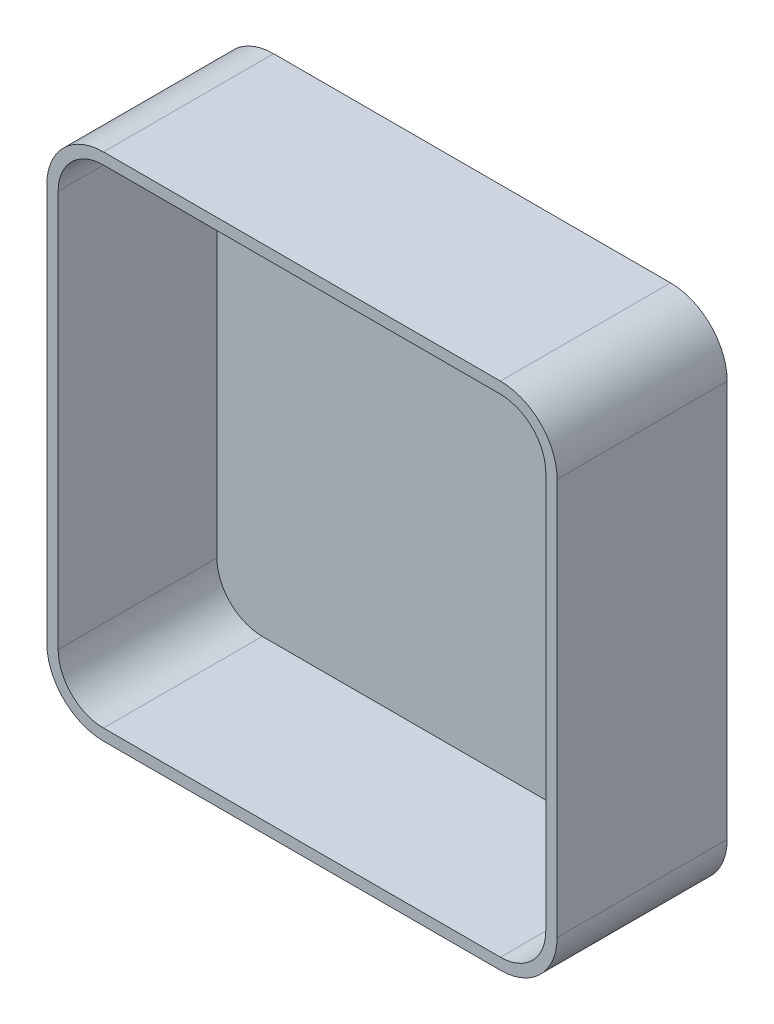
ISO-10303-21;
HEADER;
FILE_DESCRIPTION(('STEP AP214'),'2;1');
FILE_NAME('part.step','',(''),(''),'','','');
FILE_SCHEMA(('AUTOMOTIVE_DESIGN { 1 0 10303 214 1 1 1 1 }'));
ENDSEC;
DATA;
#1=APPLICATION_CONTEXT('core data for automotive mechanical design processes');
#2=APPLICATION_PROTOCOL_DEFINITION('international standard','automotive_design',2000,#1);
#3=PRODUCT_CONTEXT('',#1,'mechanical');
#4=PRODUCT('Part','Part','',(#3));
#5=PRODUCT_RELATED_PRODUCT_CATEGORY('part','',(#4));
#6=PRODUCT_DEFINITION_FORMATION('','',#4);
#7=PRODUCT_DEFINITION_CONTEXT('part definition',#1,'design');
#8=PRODUCT_DEFINITION('design','',#6,#7);
#9=PRODUCT_DEFINITION_SHAPE('','',#8);
#10=(LENGTH_UNIT() NAMED_UNIT(*) SI_UNIT(.MILLI.,.METRE.));
#11=(NAMED_UNIT(*) PLANE_ANGLE_UNIT() SI_UNIT($,.RADIAN.));
#12=(NAMED_UNIT(*) SI_UNIT($,.STERADIAN.) SOLID_ANGLE_UNIT());
#13=UNCERTAINTY_MEASURE_WITH_UNIT(LENGTH_MEASURE(1.E-05),#10,'distance_accuracy_value','');
#14=(GEOMETRIC_REPRESENTATION_CONTEXT(3) GLOBAL_UNCERTAINTY_ASSIGNED_CONTEXT((#13)) GLOBAL_UNIT_ASSIGNED_CONTEXT((#10,
#11,#12)) REPRESENTATION_CONTEXT('',''));
#15=CARTESIAN_POINT('',(0.,0.,0.));
#16=DIRECTION('',(0.,0.,1.));
#17=DIRECTION('',(1.,0.,0.));
#18=AXIS2_PLACEMENT_3D('',#15,#16,#17);
#19=CARTESIAN_POINT('',(0.,0.,15.));
#20=DIRECTION('',(1.,0.,0.));
#21=DIRECTION('',(0.,0.,-1.));
#22=AXIS2_PLACEMENT_3D('',#19,#20,#21);
#23=PLANE('',#22);
#24=DIRECTION('',(0.,-1.,0.));
#25=VECTOR('',#24,1.);
#26=CARTESIAN_POINT('',(0.,0.,0.));
#27=LINE('',#26,#25);
#28=CARTESIAN_POINT('',(0.,40.,0.));
#29=VERTEX_POINT('',#28);
#30=CARTESIAN_POINT('',(0.,5.,0.));
#31=VERTEX_POINT('',#30);
#32=EDGE_CURVE('E207',#29,#31,#27,.T.);
#33=ORIENTED_EDGE('',*,*,#32,.T.);
#34=DIRECTION('',(0.,0.,-1.));
#35=VECTOR('',#34,1.);
#36=CARTESIAN_POINT('',(0.,5.,15.));
#37=LINE('',#36,#35);
#38=CARTESIAN_POINT('',(0.,5.,15.));
#39=VERTEX_POINT('',#38);
#40=EDGE_CURVE('E258',#31,#39,#37,.F.);
#41=ORIENTED_EDGE('',*,*,#40,.T.);
#42=DIRECTION('',(0.,-1.,0.));
#43=VECTOR('',#42,1.);
#44=CARTESIAN_POINT('',(0.,0.,15.));
#45=LINE('',#44,#43);
#46=CARTESIAN_POINT('',(0.,40.,15.));
#47=VERTEX_POINT('',#46);
#48=EDGE_CURVE('E221',#47,#39,#45,.T.);
#49=ORIENTED_EDGE('',*,*,#48,.F.);
#50=DIRECTION('',(0.,0.,-1.));
#51=VECTOR('',#50,1.);
#52=CARTESIAN_POINT('',(0.,40.,15.));
#53=LINE('',#52,#51);
#54=EDGE_CURVE('E255',#47,#29,#53,.T.);
#55=ORIENTED_EDGE('',*,*,#54,.T.);
#56=EDGE_LOOP('',(#33,#41,#49,#55));
#57=FACE_BOUND('',#56,.T.);
#58=ADVANCED_FACE('F35',(#57),#23,.F.);
#59=CARTESIAN_POINT('',(0.,0.,15.));
#60=DIRECTION('',(0.,1.,0.));
#61=DIRECTION('',(0.,0.,1.));
#62=AXIS2_PLACEMENT_3D('',#59,#60,#61);
#63=PLANE('',#62);
#64=DIRECTION('',(1.,0.,0.));
#65=VECTOR('',#64,1.);
#66=CARTESIAN_POINT('',(0.,0.,15.));
#67=LINE('',#66,#65);
#68=CARTESIAN_POINT('',(5.,0.,15.));
#69=VERTEX_POINT('',#68);
#70=CARTESIAN_POINT('',(40.,0.,15.));
#71=VERTEX_POINT('',#70);
#72=EDGE_CURVE('E224',#69,#71,#67,.T.);
#73=ORIENTED_EDGE('',*,*,#72,.F.);
#74=DIRECTION('',(0.,0.,-1.));
#75=VECTOR('',#74,1.);
#76=CARTESIAN_POINT('',(5.,0.,15.));
#77=LINE('',#76,#75);
#78=CARTESIAN_POINT('',(5.,0.,0.));
#79=VERTEX_POINT('',#78);
#80=EDGE_CURVE('E244',#69,#79,#77,.T.);
#81=ORIENTED_EDGE('',*,*,#80,.T.);
#82=DIRECTION('',(1.,0.,0.));
#83=VECTOR('',#82,1.);
#84=CARTESIAN_POINT('',(0.,0.,0.));
#85=LINE('',#84,#83);
#86=CARTESIAN_POINT('',(40.,0.,0.));
#87=VERTEX_POINT('',#86);
#88=EDGE_CURVE('E236',#79,#87,#85,.T.);
#89=ORIENTED_EDGE('',*,*,#88,.T.);
#90=DIRECTION('',(0.,0.,-1.));
#91=VECTOR('',#90,1.);
#92=CARTESIAN_POINT('',(40.,0.,15.));
#93=LINE('',#92,#91);
#94=EDGE_CURVE('E233',#87,#71,#93,.F.);
#95=ORIENTED_EDGE('',*,*,#94,.T.);
#96=EDGE_LOOP('',(#73,#81,#89,#95));
#97=FACE_BOUND('',#96,.T.);
#98=ADVANCED_FACE('F304',(#97),#63,.F.);
#99=CARTESIAN_POINT('',(45.,0.,15.));
#100=DIRECTION('',(-1.,0.,0.));
#101=DIRECTION('',(0.,0.,1.));
#102=AXIS2_PLACEMENT_3D('',#99,#100,#101);
#103=PLANE('',#102);
#104=DIRECTION('',(0.,1.,0.));
#105=VECTOR('',#104,1.);
#106=CARTESIAN_POINT('',(45.,0.,15.));
#107=LINE('',#106,#105);
#108=CARTESIAN_POINT('',(45.,5.,15.));
#109=VERTEX_POINT('',#108);
#110=CARTESIAN_POINT('',(45.,40.,15.));
#111=VERTEX_POINT('',#110);
#112=EDGE_CURVE('E228',#109,#111,#107,.T.);
#113=ORIENTED_EDGE('',*,*,#112,.F.);
#114=DIRECTION('',(0.,0.,-1.));
#115=VECTOR('',#114,1.);
#116=CARTESIAN_POINT('',(45.,5.,15.));
#117=LINE('',#116,#115);
#118=CARTESIAN_POINT('',(45.,5.,0.));
#119=VERTEX_POINT('',#118);
#120=EDGE_CURVE('E270',#109,#119,#117,.T.);
#121=ORIENTED_EDGE('',*,*,#120,.T.);
#122=DIRECTION('',(0.,1.,0.));
#123=VECTOR('',#122,1.);
#124=CARTESIAN_POINT('',(45.,0.,0.));
#125=LINE('',#124,#123);
#126=CARTESIAN_POINT('',(45.,40.,0.));
#127=VERTEX_POINT('',#126);
#128=EDGE_CURVE('E239',#119,#127,#125,.T.);
#129=ORIENTED_EDGE('',*,*,#128,.T.);
#130=DIRECTION('',(0.,0.,-1.));
#131=VECTOR('',#130,1.);
#132=CARTESIAN_POINT('',(45.,40.,15.));
#133=LINE('',#132,#131);
#134=EDGE_CURVE('E268',#127,#111,#133,.F.);
#135=ORIENTED_EDGE('',*,*,#134,.T.);
#136=EDGE_LOOP('',(#113,#121,#129,#135));
#137=FACE_BOUND('',#136,.T.);
#138=ADVANCED_FACE('F276',(#137),#103,.F.);
#139=CARTESIAN_POINT('',(0.,45.,15.));
#140=DIRECTION('',(0.,-1.,0.));
#141=DIRECTION('',(0.,0.,-1.));
#142=AXIS2_PLACEMENT_3D('',#139,#140,#141);
#143=PLANE('',#142);
#144=DIRECTION('',(-1.,0.,0.));
#145=VECTOR('',#144,1.);
#146=CARTESIAN_POINT('',(0.,45.,15.));
#147=LINE('',#146,#145);
#148=CARTESIAN_POINT('',(40.,45.,15.));
#149=VERTEX_POINT('',#148);
#150=CARTESIAN_POINT('',(5.,45.,15.));
#151=VERTEX_POINT('',#150);
#152=EDGE_CURVE('E231',#149,#151,#147,.T.);
#153=ORIENTED_EDGE('',*,*,#152,.F.);
#154=DIRECTION('',(0.,0.,-1.));
#155=VECTOR('',#154,1.);
#156=CARTESIAN_POINT('',(40.,45.,15.));
#157=LINE('',#156,#155);
#158=CARTESIAN_POINT('',(40.,45.,0.));
#159=VERTEX_POINT('',#158);
#160=EDGE_CURVE('E11',#149,#159,#157,.T.);
#161=ORIENTED_EDGE('',*,*,#160,.T.);
#162=DIRECTION('',(-1.,0.,0.));
#163=VECTOR('',#162,1.);
#164=CARTESIAN_POINT('',(0.,45.,0.));
#165=LINE('',#164,#163);
#166=CARTESIAN_POINT('',(5.,45.,0.));
#167=VERTEX_POINT('',#166);
#168=EDGE_CURVE('E225',#159,#167,#165,.T.);
#169=ORIENTED_EDGE('',*,*,#168,.T.);
#170=DIRECTION('',(0.,0.,-1.));
#171=VECTOR('',#170,1.);
#172=CARTESIAN_POINT('',(5.,45.,15.));
#173=LINE('',#172,#171);
#174=EDGE_CURVE('E43',#167,#151,#173,.F.);
#175=ORIENTED_EDGE('',*,*,#174,.T.);
#176=EDGE_LOOP('',(#153,#161,#169,#175));
#177=FACE_BOUND('',#176,.T.);
#178=ADVANCED_FACE('F288',(#177),#143,.F.);
#179=CARTESIAN_POINT('',(0.,0.,15.));
#180=DIRECTION('',(0.,0.,-1.));
#181=DIRECTION('',(-1.,0.,0.));
#182=AXIS2_PLACEMENT_3D('',#179,#180,#181);
#183=PLANE('',#182);
#184=DIRECTION('',(0.,-1.,0.));
#185=VECTOR('',#184,1.);
#186=CARTESIAN_POINT('',(1.,0.,15.));
#187=LINE('',#186,#185);
#188=CARTESIAN_POINT('',(1.,40.,15.));
#189=VERTEX_POINT('',#188);
#190=CARTESIAN_POINT('',(1.,5.,15.));
#191=VERTEX_POINT('',#190);
#192=EDGE_CURVE('E176',#189,#191,#187,.T.);
#193=ORIENTED_EDGE('',*,*,#192,.F.);
#194=CARTESIAN_POINT('',(5.,40.,15.));
#195=DIRECTION('',(0.,0.,-1.));
#196=DIRECTION('',(-1.,0.,0.));
#197=AXIS2_PLACEMENT_3D('',#194,#195,#196);
#198=CIRCLE('',#197,4.);
#199=CARTESIAN_POINT('',(5.,44.,15.));
#200=VERTEX_POINT('',#199);
#201=EDGE_CURVE('E178',#200,#189,#198,.F.);
#202=ORIENTED_EDGE('',*,*,#201,.F.);
#203=DIRECTION('',(-1.,0.,0.));
#204=VECTOR('',#203,1.);
#205=CARTESIAN_POINT('',(0.,44.,15.));
#206=LINE('',#205,#204);
#207=CARTESIAN_POINT('',(40.,44.,15.));
#208=VERTEX_POINT('',#207);
#209=EDGE_CURVE('E50',#208,#200,#206,.T.);
#210=ORIENTED_EDGE('',*,*,#209,.F.);
#211=CARTESIAN_POINT('',(40.,40.,15.));
#212=DIRECTION('',(0.,0.,-1.));
#213=DIRECTION('',(-1.,0.,0.));
#214=AXIS2_PLACEMENT_3D('',#211,#212,#213);
#215=CIRCLE('',#214,4.);
#216=CARTESIAN_POINT('',(44.,40.,15.));
#217=VERTEX_POINT('',#216);
#218=EDGE_CURVE('E180',#217,#208,#215,.F.);
#219=ORIENTED_EDGE('',*,*,#218,.F.);
#220=DIRECTION('',(0.,1.,0.));
#221=VECTOR('',#220,1.);
#222=CARTESIAN_POINT('',(44.,0.,15.));
#223=LINE('',#222,#221);
#224=CARTESIAN_POINT('',(44.,4.99999999999999,15.));
#225=VERTEX_POINT('',#224);
#226=EDGE_CURVE('E215',#225,#217,#223,.T.);
#227=ORIENTED_EDGE('',*,*,#226,.F.);
#228=CARTESIAN_POINT('',(40.,5.,15.));
#229=DIRECTION('',(0.,0.,-1.));
#230=DIRECTION('',(-1.,0.,0.));
#231=AXIS2_PLACEMENT_3D('',#228,#229,#230);
#232=CIRCLE('',#231,4.);
#233=CARTESIAN_POINT('',(40.,1.,15.));
#234=VERTEX_POINT('',#233);
#235=EDGE_CURVE('E212',#234,#225,#232,.F.);
#236=ORIENTED_EDGE('',*,*,#235,.F.);
#237=DIRECTION('',(1.,0.,0.));
#238=VECTOR('',#237,1.);
#239=CARTESIAN_POINT('',(0.,1.,15.));
#240=LINE('',#239,#238);
#241=CARTESIAN_POINT('',(4.99999999999999,1.,15.));
#242=VERTEX_POINT('',#241);
#243=EDGE_CURVE('E210',#242,#234,#240,.T.);
#244=ORIENTED_EDGE('',*,*,#243,.F.);
#245=CARTESIAN_POINT('',(5.,5.,15.));
#246=DIRECTION('',(0.,0.,-1.));
#247=DIRECTION('',(-1.,0.,0.));
#248=AXIS2_PLACEMENT_3D('',#245,#246,#247);
#249=CIRCLE('',#248,4.);
#250=EDGE_CURVE('E203',#191,#242,#249,.F.);
#251=ORIENTED_EDGE('',*,*,#250,.F.);
#252=EDGE_LOOP('',(#193,#202,#210,#219,#227,#236,#244,#251));
#253=FACE_BOUND('',#252,.T.);
#254=ORIENTED_EDGE('',*,*,#48,.T.);
#255=CARTESIAN_POINT('',(5.,5.,15.));
#256=DIRECTION('',(0.,0.,-1.));
#257=DIRECTION('',(-1.,0.,0.));
#258=AXIS2_PLACEMENT_3D('',#255,#256,#257);
#259=CIRCLE('',#258,5.);
#260=EDGE_CURVE('E266',#39,#69,#259,.F.);
#261=ORIENTED_EDGE('',*,*,#260,.T.);
#262=ORIENTED_EDGE('',*,*,#72,.T.);
#263=CARTESIAN_POINT('',(40.,5.,15.));
#264=DIRECTION('',(0.,0.,-1.));
#265=DIRECTION('',(-1.,0.,0.));
#266=AXIS2_PLACEMENT_3D('',#263,#264,#265);
#267=CIRCLE('',#266,5.);
#268=EDGE_CURVE('E264',#71,#109,#267,.F.);
#269=ORIENTED_EDGE('',*,*,#268,.T.);
#270=ORIENTED_EDGE('',*,*,#112,.T.);
#271=CARTESIAN_POINT('',(40.,40.,15.));
#272=DIRECTION('',(0.,0.,-1.));
#273=DIRECTION('',(-1.,0.,0.));
#274=AXIS2_PLACEMENT_3D('',#271,#272,#273);
#275=CIRCLE('',#274,5.);
#276=EDGE_CURVE('E262',#111,#149,#275,.F.);
#277=ORIENTED_EDGE('',*,*,#276,.T.);
#278=ORIENTED_EDGE('',*,*,#152,.T.);
#279=CARTESIAN_POINT('',(5.,40.,15.));
#280=DIRECTION('',(0.,0.,-1.));
#281=DIRECTION('',(-1.,0.,0.));
#282=AXIS2_PLACEMENT_3D('',#279,#280,#281);
#283=CIRCLE('',#282,5.);
#284=EDGE_CURVE('E260',#151,#47,#283,.F.);
#285=ORIENTED_EDGE('',*,*,#284,.T.);
#286=EDGE_LOOP('',(#254,#261,#262,#269,#270,#277,#278,#285));
#287=FACE_BOUND('',#286,.T.);
#288=ADVANCED_FACE('F291',(#253,#287),#183,.F.);
#289=CARTESIAN_POINT('',(0.,0.,0.));
#290=DIRECTION('',(0.,0.,-1.));
#291=DIRECTION('',(-1.,0.,0.));
#292=AXIS2_PLACEMENT_3D('',#289,#290,#291);
#293=PLANE('',#292);
#294=ORIENTED_EDGE('',*,*,#88,.F.);
#295=CARTESIAN_POINT('',(5.,5.,0.));
#296=DIRECTION('',(0.,0.,-1.));
#297=DIRECTION('',(-1.,0.,0.));
#298=AXIS2_PLACEMENT_3D('',#295,#296,#297);
#299=CIRCLE('',#298,5.);
#300=EDGE_CURVE('E253',#79,#31,#299,.T.);
#301=ORIENTED_EDGE('',*,*,#300,.T.);
#302=ORIENTED_EDGE('',*,*,#32,.F.);
#303=CARTESIAN_POINT('',(5.,40.,0.));
#304=DIRECTION('',(0.,0.,-1.));
#305=DIRECTION('',(-1.,0.,0.));
#306=AXIS2_PLACEMENT_3D('',#303,#304,#305);
#307=CIRCLE('',#306,5.);
#308=EDGE_CURVE('E247',#29,#167,#307,.T.);
#309=ORIENTED_EDGE('',*,*,#308,.T.);
#310=ORIENTED_EDGE('',*,*,#168,.F.);
#311=CARTESIAN_POINT('',(40.,40.,0.));
#312=DIRECTION('',(0.,0.,-1.));
#313=DIRECTION('',(-1.,0.,0.));
#314=AXIS2_PLACEMENT_3D('',#311,#312,#313);
#315=CIRCLE('',#314,5.);
#316=EDGE_CURVE('E249',#159,#127,#315,.T.);
#317=ORIENTED_EDGE('',*,*,#316,.T.);
#318=ORIENTED_EDGE('',*,*,#128,.F.);
#319=CARTESIAN_POINT('',(40.,5.,0.));
#320=DIRECTION('',(0.,0.,-1.));
#321=DIRECTION('',(-1.,0.,0.));
#322=AXIS2_PLACEMENT_3D('',#319,#320,#321);
#323=CIRCLE('',#322,5.);
#324=EDGE_CURVE('E251',#119,#87,#323,.T.);
#325=ORIENTED_EDGE('',*,*,#324,.T.);
#326=EDGE_LOOP('',(#294,#301,#302,#309,#310,#317,#318,#325));
#327=FACE_BOUND('',#326,.T.);
#328=ADVANCED_FACE('F282',(#327),#293,.T.);
#329=CARTESIAN_POINT('',(5.,5.,15.));
#330=DIRECTION('',(0.,0.,-1.));
#331=DIRECTION('',(-1.,0.,0.));
#332=AXIS2_PLACEMENT_3D('',#329,#330,#331);
#333=CYLINDRICAL_SURFACE('',#332,5.);
#334=ORIENTED_EDGE('',*,*,#260,.F.);
#335=ORIENTED_EDGE('',*,*,#40,.F.);
#336=ORIENTED_EDGE('',*,*,#300,.F.);
#337=ORIENTED_EDGE('',*,*,#80,.F.);
#338=EDGE_LOOP('',(#334,#335,#336,#337));
#339=FACE_BOUND('',#338,.T.);
#340=ADVANCED_FACE('F301',(#339),#333,.T.);
#341=CARTESIAN_POINT('',(40.,5.,15.));
#342=DIRECTION('',(0.,0.,-1.));
#343=DIRECTION('',(-1.,0.,0.));
#344=AXIS2_PLACEMENT_3D('',#341,#342,#343);
#345=CYLINDRICAL_SURFACE('',#344,5.);
#346=ORIENTED_EDGE('',*,*,#268,.F.);
#347=ORIENTED_EDGE('',*,*,#94,.F.);
#348=ORIENTED_EDGE('',*,*,#324,.F.);
#349=ORIENTED_EDGE('',*,*,#120,.F.);
#350=EDGE_LOOP('',(#346,#347,#348,#349));
#351=FACE_BOUND('',#350,.T.);
#352=ADVANCED_FACE('F306',(#351),#345,.T.);
#353=CARTESIAN_POINT('',(40.,40.,15.));
#354=DIRECTION('',(0.,0.,-1.));
#355=DIRECTION('',(-1.,0.,0.));
#356=AXIS2_PLACEMENT_3D('',#353,#354,#355);
#357=CYLINDRICAL_SURFACE('',#356,5.);
#358=ORIENTED_EDGE('',*,*,#276,.F.);
#359=ORIENTED_EDGE('',*,*,#134,.F.);
#360=ORIENTED_EDGE('',*,*,#316,.F.);
#361=ORIENTED_EDGE('',*,*,#160,.F.);
#362=EDGE_LOOP('',(#358,#359,#360,#361));
#363=FACE_BOUND('',#362,.T.);
#364=ADVANCED_FACE('F287',(#363),#357,.T.);
#365=CARTESIAN_POINT('',(5.,40.,15.));
#366=DIRECTION('',(0.,0.,-1.));
#367=DIRECTION('',(-1.,0.,0.));
#368=AXIS2_PLACEMENT_3D('',#365,#366,#367);
#369=CYLINDRICAL_SURFACE('',#368,5.);
#370=ORIENTED_EDGE('',*,*,#284,.F.);
#371=ORIENTED_EDGE('',*,*,#174,.F.);
#372=ORIENTED_EDGE('',*,*,#308,.F.);
#373=ORIENTED_EDGE('',*,*,#54,.F.);
#374=EDGE_LOOP('',(#370,#371,#372,#373));
#375=FACE_BOUND('',#374,.T.);
#376=ADVANCED_FACE('F37',(#375),#369,.T.);
#377=CARTESIAN_POINT('',(1.,0.,15.));
#378=DIRECTION('',(1.,0.,0.));
#379=DIRECTION('',(0.,0.,-1.));
#380=AXIS2_PLACEMENT_3D('',#377,#378,#379);
#381=PLANE('',#380);
#382=DIRECTION('',(0.,-1.,0.));
#383=VECTOR('',#382,1.);
#384=CARTESIAN_POINT('',(1.,0.,1.));
#385=LINE('',#384,#383);
#386=CARTESIAN_POINT('',(1.,40.,1.));
#387=VERTEX_POINT('',#386);
#388=CARTESIAN_POINT('',(1.,5.,1.));
#389=VERTEX_POINT('',#388);
#390=EDGE_CURVE('E165',#387,#389,#385,.T.);
#391=ORIENTED_EDGE('',*,*,#390,.F.);
#392=DIRECTION('',(0.,0.,-1.));
#393=VECTOR('',#392,1.);
#394=CARTESIAN_POINT('',(1.,40.,15.));
#395=LINE('',#394,#393);
#396=EDGE_CURVE('E161',#189,#387,#395,.T.);
#397=ORIENTED_EDGE('',*,*,#396,.F.);
#398=ORIENTED_EDGE('',*,*,#192,.T.);
#399=DIRECTION('',(0.,0.,-1.));
#400=VECTOR('',#399,1.);
#401=CARTESIAN_POINT('',(1.,5.,15.));
#402=LINE('',#401,#400);
#403=EDGE_CURVE('E154',#389,#191,#402,.F.);
#404=ORIENTED_EDGE('',*,*,#403,.F.);
#405=EDGE_LOOP('',(#391,#397,#398,#404));
#406=FACE_BOUND('',#405,.T.);
#407=ADVANCED_FACE('F174',(#406),#381,.T.);
#408=CARTESIAN_POINT('',(0.,1.,15.));
#409=DIRECTION('',(0.,1.,0.));
#410=DIRECTION('',(0.,0.,1.));
#411=AXIS2_PLACEMENT_3D('',#408,#409,#410);
#412=PLANE('',#411);
#413=ORIENTED_EDGE('',*,*,#243,.T.);
#414=DIRECTION('',(0.,0.,1.));
#415=VECTOR('',#414,1.);
#416=CARTESIAN_POINT('',(40.,1.,15.));
#417=LINE('',#416,#415);
#418=CARTESIAN_POINT('',(40.,1.,1.));
#419=VERTEX_POINT('',#418);
#420=EDGE_CURVE('E195',#419,#234,#417,.T.);
#421=ORIENTED_EDGE('',*,*,#420,.F.);
#422=DIRECTION('',(1.,0.,0.));
#423=VECTOR('',#422,1.);
#424=CARTESIAN_POINT('',(0.,1.,1.));
#425=LINE('',#424,#423);
#426=CARTESIAN_POINT('',(4.99999999999999,1.,1.));
#427=VERTEX_POINT('',#426);
#428=EDGE_CURVE('E172',#427,#419,#425,.T.);
#429=ORIENTED_EDGE('',*,*,#428,.F.);
#430=DIRECTION('',(0.,0.,1.));
#431=VECTOR('',#430,1.);
#432=CARTESIAN_POINT('',(4.99999999999999,1.,15.));
#433=LINE('',#432,#431);
#434=EDGE_CURVE('E157',#242,#427,#433,.F.);
#435=ORIENTED_EDGE('',*,*,#434,.F.);
#436=EDGE_LOOP('',(#413,#421,#429,#435));
#437=FACE_BOUND('',#436,.T.);
#438=ADVANCED_FACE('F352',(#437),#412,.T.);
#439=CARTESIAN_POINT('',(44.,0.,15.));
#440=DIRECTION('',(-1.,0.,0.));
#441=DIRECTION('',(0.,0.,1.));
#442=AXIS2_PLACEMENT_3D('',#439,#440,#441);
#443=PLANE('',#442);
#444=ORIENTED_EDGE('',*,*,#226,.T.);
#445=DIRECTION('',(0.,0.,1.));
#446=VECTOR('',#445,1.);
#447=CARTESIAN_POINT('',(44.,40.,15.));
#448=LINE('',#447,#446);
#449=CARTESIAN_POINT('',(44.,40.,1.));
#450=VERTEX_POINT('',#449);
#451=EDGE_CURVE('E201',#450,#217,#448,.T.);
#452=ORIENTED_EDGE('',*,*,#451,.F.);
#453=DIRECTION('',(0.,1.,0.));
#454=VECTOR('',#453,1.);
#455=CARTESIAN_POINT('',(44.,0.,1.));
#456=LINE('',#455,#454);
#457=CARTESIAN_POINT('',(44.,4.99999999999999,1.));
#458=VERTEX_POINT('',#457);
#459=EDGE_CURVE('E184',#458,#450,#456,.T.);
#460=ORIENTED_EDGE('',*,*,#459,.F.);
#461=DIRECTION('',(0.,0.,1.));
#462=VECTOR('',#461,1.);
#463=CARTESIAN_POINT('',(44.,4.99999999999999,15.));
#464=LINE('',#463,#462);
#465=EDGE_CURVE('E197',#225,#458,#464,.F.);
#466=ORIENTED_EDGE('',*,*,#465,.F.);
#467=EDGE_LOOP('',(#444,#452,#460,#466));
#468=FACE_BOUND('',#467,.T.);
#469=ADVANCED_FACE('F349',(#468),#443,.T.);
#470=CARTESIAN_POINT('',(0.,44.,15.));
#471=DIRECTION('',(0.,-1.,0.));
#472=DIRECTION('',(0.,0.,-1.));
#473=AXIS2_PLACEMENT_3D('',#470,#471,#472);
#474=PLANE('',#473);
#475=ORIENTED_EDGE('',*,*,#209,.T.);
#476=DIRECTION('',(0.,0.,-1.));
#477=VECTOR('',#476,1.);
#478=CARTESIAN_POINT('',(5.,44.,15.));
#479=LINE('',#478,#477);
#480=CARTESIAN_POINT('',(5.,44.,1.));
#481=VERTEX_POINT('',#480);
#482=EDGE_CURVE('E200',#481,#200,#479,.F.);
#483=ORIENTED_EDGE('',*,*,#482,.F.);
#484=DIRECTION('',(-1.,0.,0.));
#485=VECTOR('',#484,1.);
#486=CARTESIAN_POINT('',(0.,44.,1.));
#487=LINE('',#486,#485);
#488=CARTESIAN_POINT('',(40.,44.,1.));
#489=VERTEX_POINT('',#488);
#490=EDGE_CURVE('E188',#489,#481,#487,.T.);
#491=ORIENTED_EDGE('',*,*,#490,.F.);
#492=DIRECTION('',(0.,0.,-1.));
#493=VECTOR('',#492,1.);
#494=CARTESIAN_POINT('',(40.,44.,15.));
#495=LINE('',#494,#493);
#496=EDGE_CURVE('E204',#208,#489,#495,.T.);
#497=ORIENTED_EDGE('',*,*,#496,.F.);
#498=EDGE_LOOP('',(#475,#483,#491,#497));
#499=FACE_BOUND('',#498,.T.);
#500=ADVANCED_FACE('F346',(#499),#474,.T.);
#501=CARTESIAN_POINT('',(0.,0.,1.));
#502=DIRECTION('',(0.,0.,-1.));
#503=DIRECTION('',(-1.,0.,0.));
#504=AXIS2_PLACEMENT_3D('',#501,#502,#503);
#505=PLANE('',#504);
#506=ORIENTED_EDGE('',*,*,#428,.T.);
#507=CARTESIAN_POINT('',(40.,5.,1.));
#508=DIRECTION('',(0.,0.,-1.));
#509=DIRECTION('',(-1.,0.,0.));
#510=AXIS2_PLACEMENT_3D('',#507,#508,#509);
#511=CIRCLE('',#510,4.);
#512=EDGE_CURVE('E162',#458,#419,#511,.T.);
#513=ORIENTED_EDGE('',*,*,#512,.F.);
#514=ORIENTED_EDGE('',*,*,#459,.T.);
#515=CARTESIAN_POINT('',(40.,40.,1.));
#516=DIRECTION('',(0.,0.,-1.));
#517=DIRECTION('',(-1.,0.,0.));
#518=AXIS2_PLACEMENT_3D('',#515,#516,#517);
#519=CIRCLE('',#518,4.);
#520=EDGE_CURVE('E187',#489,#450,#519,.T.);
#521=ORIENTED_EDGE('',*,*,#520,.F.);
#522=ORIENTED_EDGE('',*,*,#490,.T.);
#523=CARTESIAN_POINT('',(5.,40.,1.));
#524=DIRECTION('',(0.,0.,-1.));
#525=DIRECTION('',(-1.,0.,0.));
#526=AXIS2_PLACEMENT_3D('',#523,#524,#525);
#527=CIRCLE('',#526,4.);
#528=EDGE_CURVE('E168',#387,#481,#527,.T.);
#529=ORIENTED_EDGE('',*,*,#528,.F.);
#530=ORIENTED_EDGE('',*,*,#390,.T.);
#531=CARTESIAN_POINT('',(5.,5.,1.));
#532=DIRECTION('',(0.,0.,-1.));
#533=DIRECTION('',(-1.,0.,0.));
#534=AXIS2_PLACEMENT_3D('',#531,#532,#533);
#535=CIRCLE('',#534,4.);
#536=EDGE_CURVE('E150',#427,#389,#535,.T.);
#537=ORIENTED_EDGE('',*,*,#536,.F.);
#538=EDGE_LOOP('',(#506,#513,#514,#521,#522,#529,#530,#537));
#539=FACE_BOUND('',#538,.T.);
#540=ADVANCED_FACE('F166',(#539),#505,.F.);
#541=CARTESIAN_POINT('',(5.,5.,15.));
#542=DIRECTION('',(0.,0.,-1.));
#543=DIRECTION('',(-1.,0.,0.));
#544=AXIS2_PLACEMENT_3D('',#541,#542,#543);
#545=CYLINDRICAL_SURFACE('',#544,4.);
#546=ORIENTED_EDGE('',*,*,#250,.T.);
#547=ORIENTED_EDGE('',*,*,#434,.T.);
#548=ORIENTED_EDGE('',*,*,#536,.T.);
#549=ORIENTED_EDGE('',*,*,#403,.T.);
#550=EDGE_LOOP('',(#546,#547,#548,#549));
#551=FACE_BOUND('',#550,.T.);
#552=ADVANCED_FACE('F152',(#551),#545,.F.);
#553=CARTESIAN_POINT('',(40.,5.,15.));
#554=DIRECTION('',(0.,0.,-1.));
#555=DIRECTION('',(-1.,0.,0.));
#556=AXIS2_PLACEMENT_3D('',#553,#554,#555);
#557=CYLINDRICAL_SURFACE('',#556,4.);
#558=ORIENTED_EDGE('',*,*,#235,.T.);
#559=ORIENTED_EDGE('',*,*,#465,.T.);
#560=ORIENTED_EDGE('',*,*,#512,.T.);
#561=ORIENTED_EDGE('',*,*,#420,.T.);
#562=EDGE_LOOP('',(#558,#559,#560,#561));
#563=FACE_BOUND('',#562,.T.);
#564=ADVANCED_FACE('F337',(#563),#557,.F.);
#565=CARTESIAN_POINT('',(40.,40.,15.));
#566=DIRECTION('',(0.,0.,-1.));
#567=DIRECTION('',(-1.,0.,0.));
#568=AXIS2_PLACEMENT_3D('',#565,#566,#567);
#569=CYLINDRICAL_SURFACE('',#568,4.);
#570=ORIENTED_EDGE('',*,*,#218,.T.);
#571=ORIENTED_EDGE('',*,*,#496,.T.);
#572=ORIENTED_EDGE('',*,*,#520,.T.);
#573=ORIENTED_EDGE('',*,*,#451,.T.);
#574=EDGE_LOOP('',(#570,#571,#572,#573));
#575=FACE_BOUND('',#574,.T.);
#576=ADVANCED_FACE('F333',(#575),#569,.F.);
#577=CARTESIAN_POINT('',(5.,40.,15.));
#578=DIRECTION('',(0.,0.,-1.));
#579=DIRECTION('',(-1.,0.,0.));
#580=AXIS2_PLACEMENT_3D('',#577,#578,#579);
#581=CYLINDRICAL_SURFACE('',#580,4.);
#582=ORIENTED_EDGE('',*,*,#201,.T.);
#583=ORIENTED_EDGE('',*,*,#396,.T.);
#584=ORIENTED_EDGE('',*,*,#528,.T.);
#585=ORIENTED_EDGE('',*,*,#482,.T.);
#586=EDGE_LOOP('',(#582,#583,#584,#585));
#587=FACE_BOUND('',#586,.T.);
#588=ADVANCED_FACE('F330',(#587),#581,.F.);
#589=CLOSED_SHELL('',(#58,#98,#138,#178,#288,#328,#340,#352,#364,#376,#407,#438,#469,#500,#540,
#552,#564,#576,#588));
#590=MANIFOLD_SOLID_BREP('B2',#589);
#591=ADVANCED_BREP_SHAPE_REPRESENTATION('',(#18,#590),#14);
#592=SHAPE_DEFINITION_REPRESENTATION(#9,#591);
ENDSEC;
END-ISO-10303-21;
